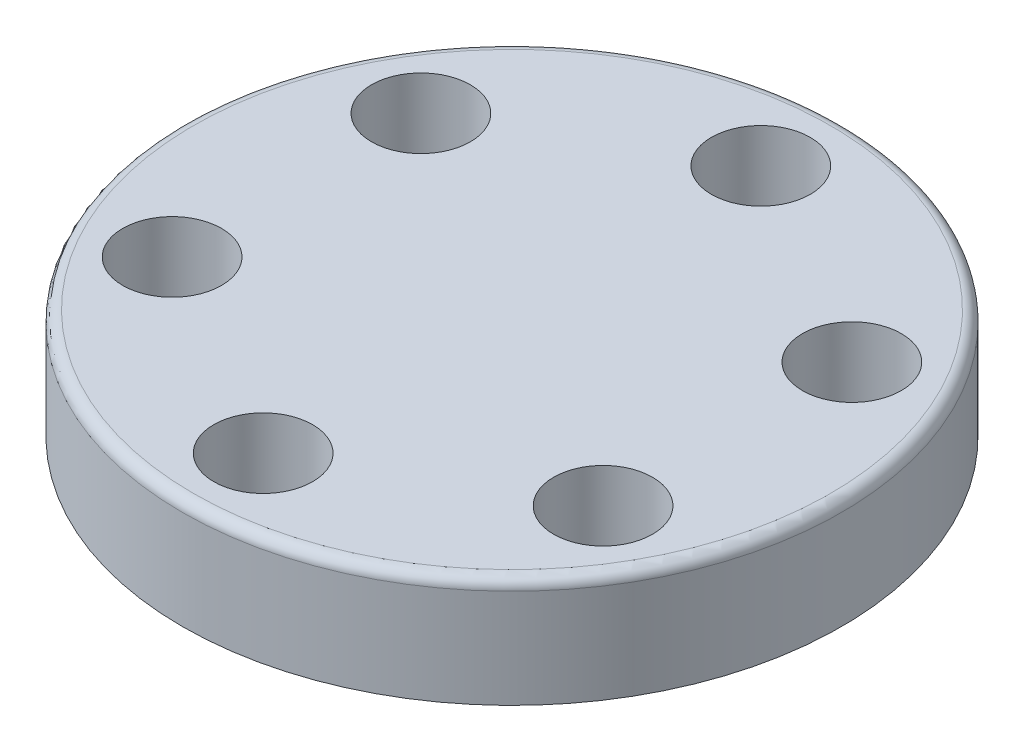
ISO-10303-21;
HEADER;
FILE_DESCRIPTION(('STEP AP214'),'2;1');
FILE_NAME('part.step','',(''),(''),'','','');
FILE_SCHEMA(('AUTOMOTIVE_DESIGN { 1 0 10303 214 1 1 1 1 }'));
ENDSEC;
DATA;
#1=APPLICATION_CONTEXT('core data for automotive mechanical design processes');
#2=APPLICATION_PROTOCOL_DEFINITION('international standard','automotive_design',2000,#1);
#3=PRODUCT_CONTEXT('',#1,'mechanical');
#4=PRODUCT('Part','Part','',(#3));
#5=PRODUCT_RELATED_PRODUCT_CATEGORY('part','',(#4));
#6=PRODUCT_DEFINITION_FORMATION('','',#4);
#7=PRODUCT_DEFINITION_CONTEXT('part definition',#1,'design');
#8=PRODUCT_DEFINITION('design','',#6,#7);
#9=PRODUCT_DEFINITION_SHAPE('','',#8);
#10=(LENGTH_UNIT() NAMED_UNIT(*) SI_UNIT(.MILLI.,.METRE.));
#11=(NAMED_UNIT(*) PLANE_ANGLE_UNIT() SI_UNIT($,.RADIAN.));
#12=(NAMED_UNIT(*) SI_UNIT($,.STERADIAN.) SOLID_ANGLE_UNIT());
#13=UNCERTAINTY_MEASURE_WITH_UNIT(LENGTH_MEASURE(1.E-05),#10,'distance_accuracy_value','');
#14=(GEOMETRIC_REPRESENTATION_CONTEXT(3) GLOBAL_UNCERTAINTY_ASSIGNED_CONTEXT((#13)) GLOBAL_UNIT_ASSIGNED_CONTEXT((#10,
#11,#12)) REPRESENTATION_CONTEXT('',''));
#15=CARTESIAN_POINT('',(0.,0.,0.));
#16=DIRECTION('',(0.,0.,1.));
#17=DIRECTION('',(1.,0.,0.));
#18=AXIS2_PLACEMENT_3D('',#15,#16,#17);
#19=CARTESIAN_POINT('',(1.58164104649594E-13,10.,-22.65));
#20=DIRECTION('',(0.,-1.,0.));
#21=DIRECTION('',(0.,0.,-1.));
#22=AXIS2_PLACEMENT_3D('',#19,#20,#21);
#23=CYLINDRICAL_SURFACE('',#22,4.5);
#24=CARTESIAN_POINT('',(1.58164104649594E-13,10.,-22.65));
#25=DIRECTION('',(0.,1.,0.));
#26=DIRECTION('',(0.,0.,1.));
#27=AXIS2_PLACEMENT_3D('',#24,#25,#26);
#28=CIRCLE('',#27,4.5);
#29=CARTESIAN_POINT('',(1.58164104649594E-13,10.,-18.15));
#30=VERTEX_POINT('',#29);
#31=EDGE_CURVE('E59',#30,#30,#28,.T.);
#32=ORIENTED_EDGE('',*,*,#31,.T.);
#33=EDGE_LOOP('',(#32));
#34=FACE_BOUND('',#33,.T.);
#35=CARTESIAN_POINT('',(-1.49186218934005E-13,3.,-22.65));
#36=DIRECTION('',(0.,-1.,0.));
#37=DIRECTION('',(0.,0.,-1.));
#38=AXIS2_PLACEMENT_3D('',#35,#36,#37);
#39=CIRCLE('',#38,4.5);
#40=CARTESIAN_POINT('',(-1.49186218934005E-13,3.,-27.15));
#41=VERTEX_POINT('',#40);
#42=EDGE_CURVE('E111',#41,#41,#39,.T.);
#43=ORIENTED_EDGE('',*,*,#42,.T.);
#44=EDGE_LOOP('',(#43));
#45=FACE_BOUND('',#44,.T.);
#46=ADVANCED_FACE('F33',(#34,#45),#23,.F.);
#47=CARTESIAN_POINT('',(19.6154753957176,10.,-11.3249999999998));
#48=DIRECTION('',(0.,-1.,0.));
#49=DIRECTION('',(0.,0.,-1.));
#50=AXIS2_PLACEMENT_3D('',#47,#48,#49);
#51=CYLINDRICAL_SURFACE('',#50,4.5);
#52=CARTESIAN_POINT('',(19.6154753957176,10.,-11.3249999999998));
#53=DIRECTION('',(0.,1.,0.));
#54=DIRECTION('',(0.,0.,1.));
#55=AXIS2_PLACEMENT_3D('',#52,#53,#54);
#56=CIRCLE('',#55,4.5);
#57=CARTESIAN_POINT('',(19.6154753957176,10.,-6.82499999999982));
#58=VERTEX_POINT('',#57);
#59=EDGE_CURVE('E62',#58,#58,#56,.T.);
#60=ORIENTED_EDGE('',*,*,#59,.T.);
#61=EDGE_LOOP('',(#60));
#62=FACE_BOUND('',#61,.T.);
#63=CARTESIAN_POINT('',(19.6154753957175,3.,-11.3250000000001));
#64=DIRECTION('',(0.,-1.,0.));
#65=DIRECTION('',(0.,0.,-1.));
#66=AXIS2_PLACEMENT_3D('',#63,#64,#65);
#67=CIRCLE('',#66,4.5);
#68=CARTESIAN_POINT('',(19.6154753957175,3.,-15.8250000000001));
#69=VERTEX_POINT('',#68);
#70=EDGE_CURVE('E102',#69,#69,#67,.T.);
#71=ORIENTED_EDGE('',*,*,#70,.T.);
#72=EDGE_LOOP('',(#71));
#73=FACE_BOUND('',#72,.T.);
#74=ADVANCED_FACE('F148',(#62,#73),#51,.F.);
#75=CARTESIAN_POINT('',(19.6154753957174,10.,11.3250000000002));
#76=DIRECTION('',(0.,-1.,0.));
#77=DIRECTION('',(0.,0.,-1.));
#78=AXIS2_PLACEMENT_3D('',#75,#76,#77);
#79=CYLINDRICAL_SURFACE('',#78,4.5);
#80=CARTESIAN_POINT('',(19.6154753957174,10.,11.3250000000002));
#81=DIRECTION('',(0.,1.,0.));
#82=DIRECTION('',(0.,0.,1.));
#83=AXIS2_PLACEMENT_3D('',#80,#81,#82);
#84=CIRCLE('',#83,4.5);
#85=CARTESIAN_POINT('',(19.6154753957174,10.,15.8250000000002));
#86=VERTEX_POINT('',#85);
#87=EDGE_CURVE('E65',#86,#86,#84,.T.);
#88=ORIENTED_EDGE('',*,*,#87,.T.);
#89=EDGE_LOOP('',(#88));
#90=FACE_BOUND('',#89,.T.);
#91=CARTESIAN_POINT('',(19.6154753957176,3.,11.325));
#92=DIRECTION('',(0.,-1.,0.));
#93=DIRECTION('',(0.,0.,-1.));
#94=AXIS2_PLACEMENT_3D('',#91,#92,#93);
#95=CIRCLE('',#94,4.5);
#96=CARTESIAN_POINT('',(19.6154753957176,3.,6.82499999999996));
#97=VERTEX_POINT('',#96);
#98=EDGE_CURVE('E93',#97,#97,#95,.T.);
#99=ORIENTED_EDGE('',*,*,#98,.T.);
#100=EDGE_LOOP('',(#99));
#101=FACE_BOUND('',#100,.T.);
#102=ADVANCED_FACE('F154',(#90,#101),#79,.F.);
#103=CARTESIAN_POINT('',(0.,10.,22.65));
#104=DIRECTION('',(0.,-1.,0.));
#105=DIRECTION('',(0.,0.,-1.));
#106=AXIS2_PLACEMENT_3D('',#103,#104,#105);
#107=CYLINDRICAL_SURFACE('',#106,4.5);
#108=CARTESIAN_POINT('',(0.,10.,22.65));
#109=DIRECTION('',(0.,1.,0.));
#110=DIRECTION('',(0.,0.,1.));
#111=AXIS2_PLACEMENT_3D('',#108,#109,#110);
#112=CIRCLE('',#111,4.5);
#113=CARTESIAN_POINT('',(0.,10.,27.15));
#114=VERTEX_POINT('',#113);
#115=EDGE_CURVE('E48',#114,#114,#112,.T.);
#116=ORIENTED_EDGE('',*,*,#115,.T.);
#117=EDGE_LOOP('',(#116));
#118=FACE_BOUND('',#117,.T.);
#119=CARTESIAN_POINT('',(0.,3.,22.65));
#120=DIRECTION('',(0.,-1.,0.));
#121=DIRECTION('',(0.,0.,-1.));
#122=AXIS2_PLACEMENT_3D('',#119,#120,#121);
#123=CIRCLE('',#122,4.5);
#124=CARTESIAN_POINT('',(0.,3.,18.15));
#125=VERTEX_POINT('',#124);
#126=EDGE_CURVE('E84',#125,#125,#123,.T.);
#127=ORIENTED_EDGE('',*,*,#126,.T.);
#128=EDGE_LOOP('',(#127));
#129=FACE_BOUND('',#128,.T.);
#130=ADVANCED_FACE('F166',(#118,#129),#107,.F.);
#131=CARTESIAN_POINT('',(-19.6154753957176,10.,11.325));
#132=DIRECTION('',(0.,-1.,0.));
#133=DIRECTION('',(0.,0.,-1.));
#134=AXIS2_PLACEMENT_3D('',#131,#132,#133);
#135=CYLINDRICAL_SURFACE('',#134,4.5);
#136=CARTESIAN_POINT('',(-19.6154753957176,10.,11.325));
#137=DIRECTION('',(0.,1.,0.));
#138=DIRECTION('',(0.,0.,1.));
#139=AXIS2_PLACEMENT_3D('',#136,#137,#138);
#140=CIRCLE('',#139,4.5);
#141=CARTESIAN_POINT('',(-19.6154753957176,10.,15.8249999999999));
#142=VERTEX_POINT('',#141);
#143=EDGE_CURVE('E53',#142,#142,#140,.T.);
#144=ORIENTED_EDGE('',*,*,#143,.T.);
#145=EDGE_LOOP('',(#144));
#146=FACE_BOUND('',#145,.T.);
#147=CARTESIAN_POINT('',(-19.6154753957176,3.,11.3249999999999));
#148=DIRECTION('',(0.,-1.,0.));
#149=DIRECTION('',(0.,0.,-1.));
#150=AXIS2_PLACEMENT_3D('',#147,#148,#149);
#151=CIRCLE('',#150,4.5);
#152=CARTESIAN_POINT('',(-19.6154753957176,3.,6.82499999999995));
#153=VERTEX_POINT('',#152);
#154=EDGE_CURVE('E75',#153,#153,#151,.T.);
#155=ORIENTED_EDGE('',*,*,#154,.T.);
#156=EDGE_LOOP('',(#155));
#157=FACE_BOUND('',#156,.T.);
#158=ADVANCED_FACE('F162',(#146,#157),#135,.F.);
#159=CARTESIAN_POINT('',(-19.6154753957175,10.,-11.3250000000001));
#160=DIRECTION('',(0.,-1.,0.));
#161=DIRECTION('',(0.,0.,-1.));
#162=AXIS2_PLACEMENT_3D('',#159,#160,#161);
#163=CYLINDRICAL_SURFACE('',#162,4.5);
#164=CARTESIAN_POINT('',(-19.6154753957175,10.,-11.3250000000001));
#165=DIRECTION('',(0.,1.,0.));
#166=DIRECTION('',(0.,0.,1.));
#167=AXIS2_PLACEMENT_3D('',#164,#165,#166);
#168=CIRCLE('',#167,4.5);
#169=CARTESIAN_POINT('',(-19.6154753957175,10.,-6.8250000000001));
#170=VERTEX_POINT('',#169);
#171=EDGE_CURVE('E56',#170,#170,#168,.T.);
#172=ORIENTED_EDGE('',*,*,#171,.T.);
#173=EDGE_LOOP('',(#172));
#174=FACE_BOUND('',#173,.T.);
#175=CARTESIAN_POINT('',(-19.6154753957175,3.,-11.3250000000001));
#176=DIRECTION('',(0.,-1.,0.));
#177=DIRECTION('',(0.,0.,-1.));
#178=AXIS2_PLACEMENT_3D('',#175,#176,#177);
#179=CIRCLE('',#178,4.5);
#180=CARTESIAN_POINT('',(-19.6154753957175,3.,-15.8250000000001));
#181=VERTEX_POINT('',#180);
#182=EDGE_CURVE('E68',#181,#181,#179,.T.);
#183=ORIENTED_EDGE('',*,*,#182,.T.);
#184=EDGE_LOOP('',(#183));
#185=FACE_BOUND('',#184,.T.);
#186=ADVANCED_FACE('F143',(#174,#185),#163,.F.);
#187=CARTESIAN_POINT('',(0.,10.,0.));
#188=DIRECTION('',(0.,1.,0.));
#189=DIRECTION('',(0.,0.,1.));
#190=AXIS2_PLACEMENT_3D('',#187,#188,#189);
#191=PLANE('',#190);
#192=CARTESIAN_POINT('',(0.,10.,0.));
#193=DIRECTION('',(0.,1.,0.));
#194=DIRECTION('',(0.,0.,1.));
#195=AXIS2_PLACEMENT_3D('',#192,#193,#194);
#196=CIRCLE('',#195,29.);
#197=CARTESIAN_POINT('',(0.,10.,29.));
#198=VERTEX_POINT('',#197);
#199=EDGE_CURVE('E40',#198,#198,#196,.T.);
#200=ORIENTED_EDGE('',*,*,#199,.T.);
#201=EDGE_LOOP('',(#200));
#202=FACE_BOUND('',#201,.T.);
#203=ORIENTED_EDGE('',*,*,#59,.F.);
#204=EDGE_LOOP('',(#203));
#205=FACE_BOUND('',#204,.T.);
#206=ORIENTED_EDGE('',*,*,#171,.F.);
#207=EDGE_LOOP('',(#206));
#208=FACE_BOUND('',#207,.T.);
#209=ORIENTED_EDGE('',*,*,#115,.F.);
#210=EDGE_LOOP('',(#209));
#211=FACE_BOUND('',#210,.T.);
#212=ORIENTED_EDGE('',*,*,#143,.F.);
#213=EDGE_LOOP('',(#212));
#214=FACE_BOUND('',#213,.T.);
#215=ORIENTED_EDGE('',*,*,#31,.F.);
#216=EDGE_LOOP('',(#215));
#217=FACE_BOUND('',#216,.T.);
#218=ORIENTED_EDGE('',*,*,#87,.F.);
#219=EDGE_LOOP('',(#218));
#220=FACE_BOUND('',#219,.T.);
#221=ADVANCED_FACE('F135',(#202,#205,#208,#211,#214,#217,#220),#191,.T.);
#222=CARTESIAN_POINT('',(0.,0.,0.));
#223=DIRECTION('',(0.,1.,0.));
#224=DIRECTION('',(0.,0.,1.));
#225=AXIS2_PLACEMENT_3D('',#222,#223,#224);
#226=PLANE('',#225);
#227=CARTESIAN_POINT('',(0.,0.,0.));
#228=DIRECTION('',(0.,1.,0.));
#229=DIRECTION('',(0.,0.,1.));
#230=AXIS2_PLACEMENT_3D('',#227,#228,#229);
#231=CIRCLE('',#230,30.);
#232=CARTESIAN_POINT('',(0.,0.,30.));
#233=VERTEX_POINT('',#232);
#234=EDGE_CURVE('E44',#233,#233,#231,.T.);
#235=ORIENTED_EDGE('',*,*,#234,.F.);
#236=EDGE_LOOP('',(#235));
#237=FACE_BOUND('',#236,.T.);
#238=CARTESIAN_POINT('',(-19.6154753957175,0.,-11.3250000000001));
#239=DIRECTION('',(0.,-1.,0.));
#240=DIRECTION('',(0.,0.,-1.));
#241=AXIS2_PLACEMENT_3D('',#238,#239,#240);
#242=CIRCLE('',#241,2.5);
#243=CARTESIAN_POINT('',(-19.6154753957175,0.,-13.8250000000001));
#244=VERTEX_POINT('',#243);
#245=EDGE_CURVE('E72',#244,#244,#242,.T.);
#246=ORIENTED_EDGE('',*,*,#245,.F.);
#247=EDGE_LOOP('',(#246));
#248=FACE_BOUND('',#247,.T.);
#249=CARTESIAN_POINT('',(-19.6154753957176,0.,11.3249999999999));
#250=DIRECTION('',(0.,-1.,0.));
#251=DIRECTION('',(0.,0.,-1.));
#252=AXIS2_PLACEMENT_3D('',#249,#250,#251);
#253=CIRCLE('',#252,2.5);
#254=CARTESIAN_POINT('',(-19.6154753957176,0.,8.82499999999995));
#255=VERTEX_POINT('',#254);
#256=EDGE_CURVE('E81',#255,#255,#253,.T.);
#257=ORIENTED_EDGE('',*,*,#256,.F.);
#258=EDGE_LOOP('',(#257));
#259=FACE_BOUND('',#258,.T.);
#260=CARTESIAN_POINT('',(0.,0.,22.65));
#261=DIRECTION('',(0.,-1.,0.));
#262=DIRECTION('',(0.,0.,-1.));
#263=AXIS2_PLACEMENT_3D('',#260,#261,#262);
#264=CIRCLE('',#263,2.5);
#265=CARTESIAN_POINT('',(0.,0.,20.15));
#266=VERTEX_POINT('',#265);
#267=EDGE_CURVE('E90',#266,#266,#264,.T.);
#268=ORIENTED_EDGE('',*,*,#267,.F.);
#269=EDGE_LOOP('',(#268));
#270=FACE_BOUND('',#269,.T.);
#271=CARTESIAN_POINT('',(19.6154753957176,0.,11.325));
#272=DIRECTION('',(0.,-1.,0.));
#273=DIRECTION('',(0.,0.,-1.));
#274=AXIS2_PLACEMENT_3D('',#271,#272,#273);
#275=CIRCLE('',#274,2.5);
#276=CARTESIAN_POINT('',(19.6154753957176,0.,8.82499999999996));
#277=VERTEX_POINT('',#276);
#278=EDGE_CURVE('E99',#277,#277,#275,.T.);
#279=ORIENTED_EDGE('',*,*,#278,.F.);
#280=EDGE_LOOP('',(#279));
#281=FACE_BOUND('',#280,.T.);
#282=CARTESIAN_POINT('',(19.6154753957175,0.,-11.3250000000001));
#283=DIRECTION('',(0.,-1.,0.));
#284=DIRECTION('',(0.,0.,-1.));
#285=AXIS2_PLACEMENT_3D('',#282,#283,#284);
#286=CIRCLE('',#285,2.5);
#287=CARTESIAN_POINT('',(19.6154753957175,0.,-13.8250000000001));
#288=VERTEX_POINT('',#287);
#289=EDGE_CURVE('E108',#288,#288,#286,.T.);
#290=ORIENTED_EDGE('',*,*,#289,.F.);
#291=EDGE_LOOP('',(#290));
#292=FACE_BOUND('',#291,.T.);
#293=CARTESIAN_POINT('',(-1.49186218934005E-13,0.,-22.65));
#294=DIRECTION('',(0.,-1.,0.));
#295=DIRECTION('',(0.,0.,-1.));
#296=AXIS2_PLACEMENT_3D('',#293,#294,#295);
#297=CIRCLE('',#296,2.5);
#298=CARTESIAN_POINT('',(-1.49186218934005E-13,0.,-25.15));
#299=VERTEX_POINT('',#298);
#300=EDGE_CURVE('E117',#299,#299,#297,.T.);
#301=ORIENTED_EDGE('',*,*,#300,.F.);
#302=EDGE_LOOP('',(#301));
#303=FACE_BOUND('',#302,.T.);
#304=ADVANCED_FACE('F132',(#237,#248,#259,#270,#281,#292,#303),#226,.F.);
#305=CARTESIAN_POINT('',(0.,10.,0.));
#306=DIRECTION('',(0.,-1.,0.));
#307=DIRECTION('',(0.,0.,-1.));
#308=AXIS2_PLACEMENT_3D('',#305,#306,#307);
#309=CYLINDRICAL_SURFACE('',#308,30.);
#310=CARTESIAN_POINT('',(0.,9.,0.));
#311=DIRECTION('',(0.,1.,0.));
#312=DIRECTION('',(0.,0.,1.));
#313=AXIS2_PLACEMENT_3D('',#310,#311,#312);
#314=CIRCLE('',#313,30.);
#315=CARTESIAN_POINT('',(0.,9.,30.));
#316=VERTEX_POINT('',#315);
#317=EDGE_CURVE('E10',#316,#316,#314,.F.);
#318=ORIENTED_EDGE('',*,*,#317,.T.);
#319=EDGE_LOOP('',(#318));
#320=FACE_BOUND('',#319,.T.);
#321=ORIENTED_EDGE('',*,*,#234,.T.);
#322=EDGE_LOOP('',(#321));
#323=FACE_BOUND('',#322,.T.);
#324=ADVANCED_FACE('F134',(#320,#323),#309,.T.);
#325=CARTESIAN_POINT('',(-19.6154753957175,3.,-11.3250000000001));
#326=DIRECTION('',(0.,-1.,0.));
#327=DIRECTION('',(0.,0.,-1.));
#328=AXIS2_PLACEMENT_3D('',#325,#326,#327);
#329=PLANE('',#328);
#330=CARTESIAN_POINT('',(-19.6154753957175,3.,-11.3250000000001));
#331=DIRECTION('',(0.,-1.,0.));
#332=DIRECTION('',(0.,0.,-1.));
#333=AXIS2_PLACEMENT_3D('',#330,#331,#332);
#334=CIRCLE('',#333,2.5);
#335=CARTESIAN_POINT('',(-19.6154753957175,3.,-13.8250000000001));
#336=VERTEX_POINT('',#335);
#337=EDGE_CURVE('E71',#336,#336,#334,.T.);
#338=ORIENTED_EDGE('',*,*,#337,.T.);
#339=EDGE_LOOP('',(#338));
#340=FACE_BOUND('',#339,.T.);
#341=ORIENTED_EDGE('',*,*,#182,.F.);
#342=EDGE_LOOP('',(#341));
#343=FACE_BOUND('',#342,.T.);
#344=ADVANCED_FACE('F142',(#340,#343),#329,.F.);
#345=CARTESIAN_POINT('',(-19.6154753957175,3.,-11.3250000000001));
#346=DIRECTION('',(0.,-1.,0.));
#347=DIRECTION('',(0.,0.,-1.));
#348=AXIS2_PLACEMENT_3D('',#345,#346,#347);
#349=CYLINDRICAL_SURFACE('',#348,2.5);
#350=ORIENTED_EDGE('',*,*,#337,.F.);
#351=EDGE_LOOP('',(#350));
#352=FACE_BOUND('',#351,.T.);
#353=ORIENTED_EDGE('',*,*,#245,.T.);
#354=EDGE_LOOP('',(#353));
#355=FACE_BOUND('',#354,.T.);
#356=ADVANCED_FACE('F198',(#352,#355),#349,.F.);
#357=CARTESIAN_POINT('',(-19.6154753957176,3.,11.3249999999999));
#358=DIRECTION('',(0.,-1.,0.));
#359=DIRECTION('',(0.,0.,-1.));
#360=AXIS2_PLACEMENT_3D('',#357,#358,#359);
#361=PLANE('',#360);
#362=CARTESIAN_POINT('',(-19.6154753957176,3.,11.3249999999999));
#363=DIRECTION('',(0.,-1.,0.));
#364=DIRECTION('',(0.,0.,-1.));
#365=AXIS2_PLACEMENT_3D('',#362,#363,#364);
#366=CIRCLE('',#365,2.5);
#367=CARTESIAN_POINT('',(-19.6154753957176,3.,8.82499999999995));
#368=VERTEX_POINT('',#367);
#369=EDGE_CURVE('E80',#368,#368,#366,.T.);
#370=ORIENTED_EDGE('',*,*,#369,.T.);
#371=EDGE_LOOP('',(#370));
#372=FACE_BOUND('',#371,.T.);
#373=ORIENTED_EDGE('',*,*,#154,.F.);
#374=EDGE_LOOP('',(#373));
#375=FACE_BOUND('',#374,.T.);
#376=ADVANCED_FACE('F191',(#372,#375),#361,.F.);
#377=CARTESIAN_POINT('',(-19.6154753957176,3.,11.3249999999999));
#378=DIRECTION('',(0.,-1.,0.));
#379=DIRECTION('',(0.,0.,-1.));
#380=AXIS2_PLACEMENT_3D('',#377,#378,#379);
#381=CYLINDRICAL_SURFACE('',#380,2.5);
#382=ORIENTED_EDGE('',*,*,#369,.F.);
#383=EDGE_LOOP('',(#382));
#384=FACE_BOUND('',#383,.T.);
#385=ORIENTED_EDGE('',*,*,#256,.T.);
#386=EDGE_LOOP('',(#385));
#387=FACE_BOUND('',#386,.T.);
#388=ADVANCED_FACE('F181',(#384,#387),#381,.F.);
#389=CARTESIAN_POINT('',(0.,3.,22.65));
#390=DIRECTION('',(0.,-1.,0.));
#391=DIRECTION('',(0.,0.,-1.));
#392=AXIS2_PLACEMENT_3D('',#389,#390,#391);
#393=PLANE('',#392);
#394=CARTESIAN_POINT('',(0.,3.,22.65));
#395=DIRECTION('',(0.,-1.,0.));
#396=DIRECTION('',(0.,0.,-1.));
#397=AXIS2_PLACEMENT_3D('',#394,#395,#396);
#398=CIRCLE('',#397,2.5);
#399=CARTESIAN_POINT('',(0.,3.,20.15));
#400=VERTEX_POINT('',#399);
#401=EDGE_CURVE('E89',#400,#400,#398,.T.);
#402=ORIENTED_EDGE('',*,*,#401,.T.);
#403=EDGE_LOOP('',(#402));
#404=FACE_BOUND('',#403,.T.);
#405=ORIENTED_EDGE('',*,*,#126,.F.);
#406=EDGE_LOOP('',(#405));
#407=FACE_BOUND('',#406,.T.);
#408=ADVANCED_FACE('F178',(#404,#407),#393,.F.);
#409=CARTESIAN_POINT('',(0.,3.,22.65));
#410=DIRECTION('',(0.,-1.,0.));
#411=DIRECTION('',(0.,0.,-1.));
#412=AXIS2_PLACEMENT_3D('',#409,#410,#411);
#413=CYLINDRICAL_SURFACE('',#412,2.5);
#414=ORIENTED_EDGE('',*,*,#401,.F.);
#415=EDGE_LOOP('',(#414));
#416=FACE_BOUND('',#415,.T.);
#417=ORIENTED_EDGE('',*,*,#267,.T.);
#418=EDGE_LOOP('',(#417));
#419=FACE_BOUND('',#418,.T.);
#420=ADVANCED_FACE('F180',(#416,#419),#413,.F.);
#421=CARTESIAN_POINT('',(19.6154753957176,3.,11.325));
#422=DIRECTION('',(0.,-1.,0.));
#423=DIRECTION('',(0.,0.,-1.));
#424=AXIS2_PLACEMENT_3D('',#421,#422,#423);
#425=PLANE('',#424);
#426=CARTESIAN_POINT('',(19.6154753957176,3.,11.325));
#427=DIRECTION('',(0.,-1.,0.));
#428=DIRECTION('',(0.,0.,-1.));
#429=AXIS2_PLACEMENT_3D('',#426,#427,#428);
#430=CIRCLE('',#429,2.5);
#431=CARTESIAN_POINT('',(19.6154753957176,3.,8.82499999999996));
#432=VERTEX_POINT('',#431);
#433=EDGE_CURVE('E98',#432,#432,#430,.T.);
#434=ORIENTED_EDGE('',*,*,#433,.T.);
#435=EDGE_LOOP('',(#434));
#436=FACE_BOUND('',#435,.T.);
#437=ORIENTED_EDGE('',*,*,#98,.F.);
#438=EDGE_LOOP('',(#437));
#439=FACE_BOUND('',#438,.T.);
#440=ADVANCED_FACE('F188',(#436,#439),#425,.F.);
#441=CARTESIAN_POINT('',(19.6154753957176,3.,11.325));
#442=DIRECTION('',(0.,-1.,0.));
#443=DIRECTION('',(0.,0.,-1.));
#444=AXIS2_PLACEMENT_3D('',#441,#442,#443);
#445=CYLINDRICAL_SURFACE('',#444,2.5);
#446=ORIENTED_EDGE('',*,*,#433,.F.);
#447=EDGE_LOOP('',(#446));
#448=FACE_BOUND('',#447,.T.);
#449=ORIENTED_EDGE('',*,*,#278,.T.);
#450=EDGE_LOOP('',(#449));
#451=FACE_BOUND('',#450,.T.);
#452=ADVANCED_FACE('F232',(#448,#451),#445,.F.);
#453=CARTESIAN_POINT('',(19.6154753957175,3.,-11.3250000000001));
#454=DIRECTION('',(0.,-1.,0.));
#455=DIRECTION('',(0.,0.,-1.));
#456=AXIS2_PLACEMENT_3D('',#453,#454,#455);
#457=PLANE('',#456);
#458=CARTESIAN_POINT('',(19.6154753957175,3.,-11.3250000000001));
#459=DIRECTION('',(0.,-1.,0.));
#460=DIRECTION('',(0.,0.,-1.));
#461=AXIS2_PLACEMENT_3D('',#458,#459,#460);
#462=CIRCLE('',#461,2.5);
#463=CARTESIAN_POINT('',(19.6154753957175,3.,-13.8250000000001));
#464=VERTEX_POINT('',#463);
#465=EDGE_CURVE('E107',#464,#464,#462,.T.);
#466=ORIENTED_EDGE('',*,*,#465,.T.);
#467=EDGE_LOOP('',(#466));
#468=FACE_BOUND('',#467,.T.);
#469=ORIENTED_EDGE('',*,*,#70,.F.);
#470=EDGE_LOOP('',(#469));
#471=FACE_BOUND('',#470,.T.);
#472=ADVANCED_FACE('F224',(#468,#471),#457,.F.);
#473=CARTESIAN_POINT('',(19.6154753957175,3.,-11.3250000000001));
#474=DIRECTION('',(0.,-1.,0.));
#475=DIRECTION('',(0.,0.,-1.));
#476=AXIS2_PLACEMENT_3D('',#473,#474,#475);
#477=CYLINDRICAL_SURFACE('',#476,2.5);
#478=ORIENTED_EDGE('',*,*,#465,.F.);
#479=EDGE_LOOP('',(#478));
#480=FACE_BOUND('',#479,.T.);
#481=ORIENTED_EDGE('',*,*,#289,.T.);
#482=EDGE_LOOP('',(#481));
#483=FACE_BOUND('',#482,.T.);
#484=ADVANCED_FACE('F222',(#480,#483),#477,.F.);
#485=CARTESIAN_POINT('',(-1.49186218934005E-13,3.,-22.65));
#486=DIRECTION('',(0.,-1.,0.));
#487=DIRECTION('',(0.,0.,-1.));
#488=AXIS2_PLACEMENT_3D('',#485,#486,#487);
#489=PLANE('',#488);
#490=CARTESIAN_POINT('',(-1.49186218934005E-13,3.,-22.65));
#491=DIRECTION('',(0.,-1.,0.));
#492=DIRECTION('',(0.,0.,-1.));
#493=AXIS2_PLACEMENT_3D('',#490,#491,#492);
#494=CIRCLE('',#493,2.5);
#495=CARTESIAN_POINT('',(-1.49186218934005E-13,3.,-25.15));
#496=VERTEX_POINT('',#495);
#497=EDGE_CURVE('E116',#496,#496,#494,.T.);
#498=ORIENTED_EDGE('',*,*,#497,.T.);
#499=EDGE_LOOP('',(#498));
#500=FACE_BOUND('',#499,.T.);
#501=ORIENTED_EDGE('',*,*,#42,.F.);
#502=EDGE_LOOP('',(#501));
#503=FACE_BOUND('',#502,.T.);
#504=ADVANCED_FACE('F123',(#500,#503),#489,.F.);
#505=CARTESIAN_POINT('',(-1.49186218934005E-13,3.,-22.65));
#506=DIRECTION('',(0.,-1.,0.));
#507=DIRECTION('',(0.,0.,-1.));
#508=AXIS2_PLACEMENT_3D('',#505,#506,#507);
#509=CYLINDRICAL_SURFACE('',#508,2.5);
#510=ORIENTED_EDGE('',*,*,#497,.F.);
#511=EDGE_LOOP('',(#510));
#512=FACE_BOUND('',#511,.T.);
#513=ORIENTED_EDGE('',*,*,#300,.T.);
#514=EDGE_LOOP('',(#513));
#515=FACE_BOUND('',#514,.T.);
#516=ADVANCED_FACE('F126',(#512,#515),#509,.F.);
#517=CARTESIAN_POINT('',(0.,9.,0.));
#518=DIRECTION('',(0.,1.,0.));
#519=DIRECTION('',(0.,0.,1.));
#520=AXIS2_PLACEMENT_3D('',#517,#518,#519);
#521=TOROIDAL_SURFACE('',#520,29.,1.);
#522=ORIENTED_EDGE('',*,*,#317,.F.);
#523=EDGE_LOOP('',(#522));
#524=FACE_BOUND('',#523,.T.);
#525=ORIENTED_EDGE('',*,*,#199,.F.);
#526=EDGE_LOOP('',(#525));
#527=FACE_BOUND('',#526,.T.);
#528=ADVANCED_FACE('F35',(#524,#527),#521,.T.);
#529=CLOSED_SHELL('',(#46,#74,#102,#130,#158,#186,#221,#304,#324,#344,#356,#376,#388,#408,#420,
#440,#452,#472,#484,#504,#516,#528));
#530=MANIFOLD_SOLID_BREP('B2',#529);
#531=ADVANCED_BREP_SHAPE_REPRESENTATION('',(#18,#530),#14);
#532=SHAPE_DEFINITION_REPRESENTATION(#9,#531);
ENDSEC;
END-ISO-10303-21;
